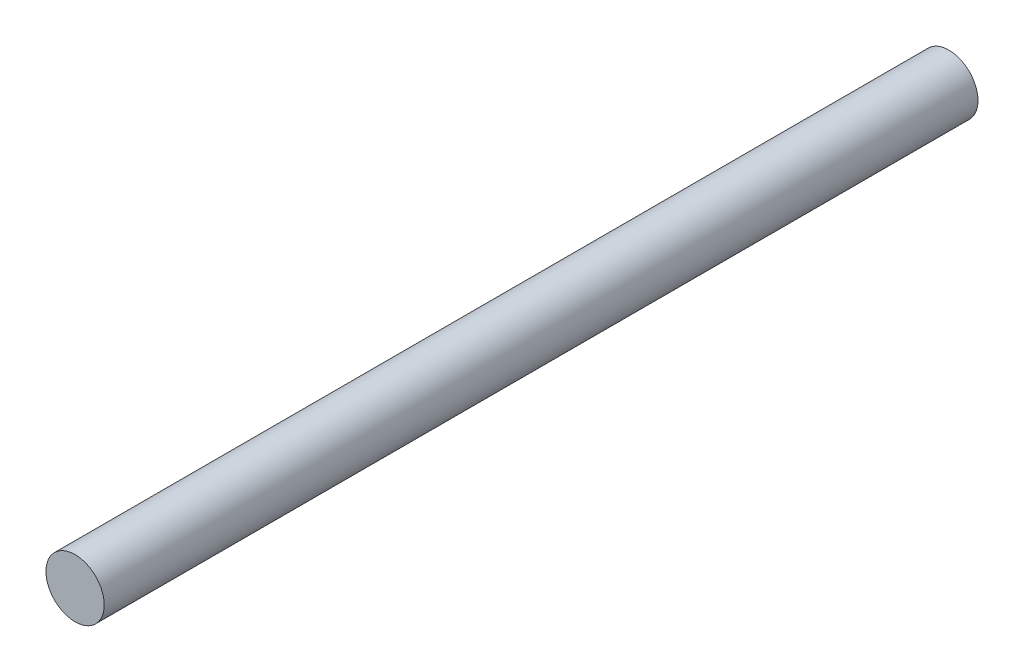
ISO-10303-21;
HEADER;
FILE_DESCRIPTION(('STEP AP214'),'2;1');
FILE_NAME('part.step','',(''),(''),'','','');
FILE_SCHEMA(('AUTOMOTIVE_DESIGN { 1 0 10303 214 1 1 1 1 }'));
ENDSEC;
DATA;
#1=APPLICATION_CONTEXT('core data for automotive mechanical design processes');
#2=APPLICATION_PROTOCOL_DEFINITION('international standard','automotive_design',2000,#1);
#3=PRODUCT_CONTEXT('',#1,'mechanical');
#4=PRODUCT('Part','Part','',(#3));
#5=PRODUCT_RELATED_PRODUCT_CATEGORY('part','',(#4));
#6=PRODUCT_DEFINITION_FORMATION('','',#4);
#7=PRODUCT_DEFINITION_CONTEXT('part definition',#1,'design');
#8=PRODUCT_DEFINITION('design','',#6,#7);
#9=PRODUCT_DEFINITION_SHAPE('','',#8);
#10=(LENGTH_UNIT() NAMED_UNIT(*) SI_UNIT(.MILLI.,.METRE.));
#11=(NAMED_UNIT(*) PLANE_ANGLE_UNIT() SI_UNIT($,.RADIAN.));
#12=(NAMED_UNIT(*) SI_UNIT($,.STERADIAN.) SOLID_ANGLE_UNIT());
#13=UNCERTAINTY_MEASURE_WITH_UNIT(LENGTH_MEASURE(1.E-05),#10,'distance_accuracy_value','');
#14=(GEOMETRIC_REPRESENTATION_CONTEXT(3) GLOBAL_UNCERTAINTY_ASSIGNED_CONTEXT((#13)) GLOBAL_UNIT_ASSIGNED_CONTEXT((#10,
#11,#12)) REPRESENTATION_CONTEXT('',''));
#15=CARTESIAN_POINT('',(0.,0.,0.));
#16=DIRECTION('',(0.,0.,1.));
#17=DIRECTION('',(1.,0.,0.));
#18=AXIS2_PLACEMENT_3D('',#15,#16,#17);
#19=CARTESIAN_POINT('',(0.,0.,150.));
#20=DIRECTION('',(0.,0.,-1.));
#21=DIRECTION('',(-1.,0.,0.));
#22=AXIS2_PLACEMENT_3D('',#19,#20,#21);
#23=CYLINDRICAL_SURFACE('',#22,5.);
#24=CARTESIAN_POINT('',(0.,0.,150.));
#25=DIRECTION('',(0.,0.,1.));
#26=DIRECTION('',(1.,0.,0.));
#27=AXIS2_PLACEMENT_3D('',#24,#25,#26);
#28=CIRCLE('',#27,5.);
#29=CARTESIAN_POINT('',(5.,0.,150.));
#30=VERTEX_POINT('',#29);
#31=EDGE_CURVE('E10',#30,#30,#28,.T.);
#32=ORIENTED_EDGE('',*,*,#31,.F.);
#33=EDGE_LOOP('',(#32));
#34=FACE_BOUND('',#33,.T.);
#35=CARTESIAN_POINT('',(0.,0.,0.));
#36=DIRECTION('',(0.,0.,1.));
#37=DIRECTION('',(1.,0.,0.));
#38=AXIS2_PLACEMENT_3D('',#35,#36,#37);
#39=CIRCLE('',#38,5.);
#40=CARTESIAN_POINT('',(5.,0.,0.));
#41=VERTEX_POINT('',#40);
#42=EDGE_CURVE('E38',#41,#41,#39,.T.);
#43=ORIENTED_EDGE('',*,*,#42,.T.);
#44=EDGE_LOOP('',(#43));
#45=FACE_BOUND('',#44,.T.);
#46=ADVANCED_FACE('F35',(#34,#45),#23,.T.);
#47=CARTESIAN_POINT('',(0.,0.,150.));
#48=DIRECTION('',(0.,0.,1.));
#49=DIRECTION('',(1.,0.,0.));
#50=AXIS2_PLACEMENT_3D('',#47,#48,#49);
#51=PLANE('',#50);
#52=ORIENTED_EDGE('',*,*,#31,.T.);
#53=EDGE_LOOP('',(#52));
#54=FACE_BOUND('',#53,.T.);
#55=ADVANCED_FACE('F50',(#54),#51,.T.);
#56=CARTESIAN_POINT('',(0.,0.,0.));
#57=DIRECTION('',(0.,0.,1.));
#58=DIRECTION('',(1.,0.,0.));
#59=AXIS2_PLACEMENT_3D('',#56,#57,#58);
#60=PLANE('',#59);
#61=ORIENTED_EDGE('',*,*,#42,.F.);
#62=EDGE_LOOP('',(#61));
#63=FACE_BOUND('',#62,.T.);
#64=ADVANCED_FACE('F48',(#63),#60,.F.);
#65=CLOSED_SHELL('',(#46,#55,#64));
#66=MANIFOLD_SOLID_BREP('B2',#65);
#67=ADVANCED_BREP_SHAPE_REPRESENTATION('',(#18,#66),#14);
#68=SHAPE_DEFINITION_REPRESENTATION(#9,#67);
ENDSEC;
END-ISO-10303-21;
